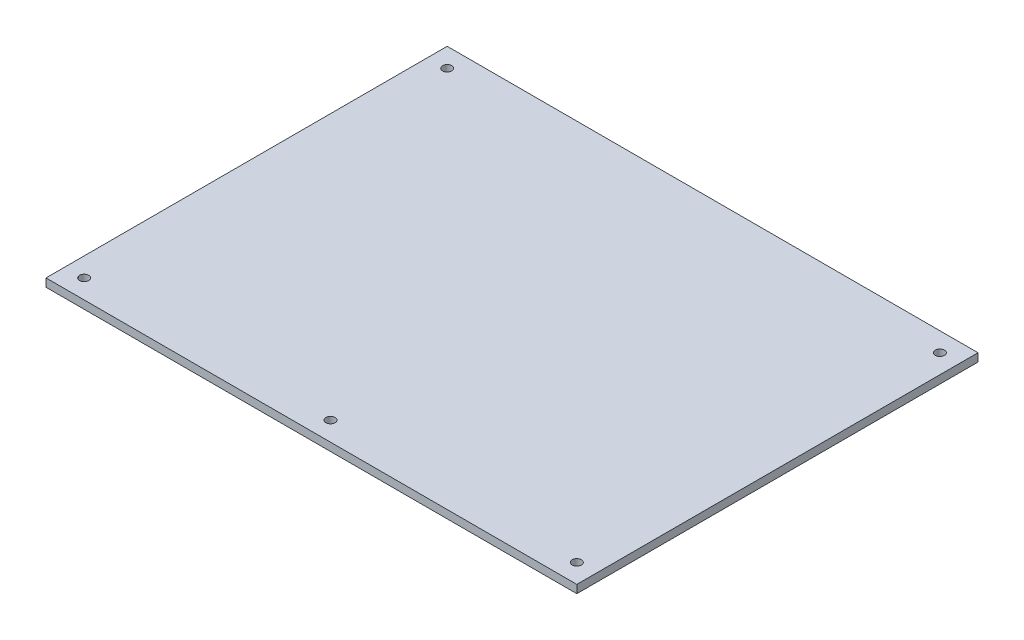
ISO-10303-21;
HEADER;
FILE_DESCRIPTION(('STEP AP214'),'2;1');
FILE_NAME('part.step','',(''),(''),'','','');
FILE_SCHEMA(('AUTOMOTIVE_DESIGN { 1 0 10303 214 1 1 1 1 }'));
ENDSEC;
DATA;
#1=APPLICATION_CONTEXT('core data for automotive mechanical design processes');
#2=APPLICATION_PROTOCOL_DEFINITION('international standard','automotive_design',2000,#1);
#3=PRODUCT_CONTEXT('',#1,'mechanical');
#4=PRODUCT('Part','Part','',(#3));
#5=PRODUCT_RELATED_PRODUCT_CATEGORY('part','',(#4));
#6=PRODUCT_DEFINITION_FORMATION('','',#4);
#7=PRODUCT_DEFINITION_CONTEXT('part definition',#1,'design');
#8=PRODUCT_DEFINITION('design','',#6,#7);
#9=PRODUCT_DEFINITION_SHAPE('','',#8);
#10=(LENGTH_UNIT() NAMED_UNIT(*) SI_UNIT(.MILLI.,.METRE.));
#11=(NAMED_UNIT(*) PLANE_ANGLE_UNIT() SI_UNIT($,.RADIAN.));
#12=(NAMED_UNIT(*) SI_UNIT($,.STERADIAN.) SOLID_ANGLE_UNIT());
#13=UNCERTAINTY_MEASURE_WITH_UNIT(LENGTH_MEASURE(1.E-05),#10,'distance_accuracy_value','');
#14=(GEOMETRIC_REPRESENTATION_CONTEXT(3) GLOBAL_UNCERTAINTY_ASSIGNED_CONTEXT((#13)) GLOBAL_UNIT_ASSIGNED_CONTEXT((#10,
#11,#12)) REPRESENTATION_CONTEXT('',''));
#15=CARTESIAN_POINT('',(0.,0.,0.));
#16=DIRECTION('',(0.,0.,1.));
#17=DIRECTION('',(1.,0.,0.));
#18=AXIS2_PLACEMENT_3D('',#15,#16,#17);
#19=CARTESIAN_POINT('',(169.960120169601,6.35,301.624858514461));
#20=DIRECTION('',(-1.,0.,0.));
#21=DIRECTION('',(0.,0.,1.));
#22=AXIS2_PLACEMENT_3D('',#19,#20,#21);
#23=PLANE('',#22);
#24=DIRECTION('',(0.,0.,-1.));
#25=VECTOR('',#24,1.);
#26=CARTESIAN_POINT('',(169.960120169601,0.,301.624858514461));
#27=LINE('',#26,#25);
#28=CARTESIAN_POINT('',(169.960120169601,0.,301.624858514461));
#29=VERTEX_POINT('',#28);
#30=CARTESIAN_POINT('',(169.960120169601,0.,-12.8551414855386));
#31=VERTEX_POINT('',#30);
#32=EDGE_CURVE('E104',#29,#31,#27,.T.);
#33=ORIENTED_EDGE('',*,*,#32,.T.);
#34=DIRECTION('',(0.,-1.,0.));
#35=VECTOR('',#34,1.);
#36=CARTESIAN_POINT('',(169.960120169601,6.35,-12.8551414855386));
#37=LINE('',#36,#35);
#38=CARTESIAN_POINT('',(169.960120169601,6.35,-12.8551414855386));
#39=VERTEX_POINT('',#38);
#40=EDGE_CURVE('E11',#39,#31,#37,.T.);
#41=ORIENTED_EDGE('',*,*,#40,.F.);
#42=DIRECTION('',(0.,0.,-1.));
#43=VECTOR('',#42,1.);
#44=CARTESIAN_POINT('',(169.960120169601,6.35,301.624858514461));
#45=LINE('',#44,#43);
#46=CARTESIAN_POINT('',(169.960120169601,6.35,301.624858514461));
#47=VERTEX_POINT('',#46);
#48=EDGE_CURVE('E92',#47,#39,#45,.T.);
#49=ORIENTED_EDGE('',*,*,#48,.F.);
#50=DIRECTION('',(0.,-1.,0.));
#51=VECTOR('',#50,1.);
#52=CARTESIAN_POINT('',(169.960120169601,6.35,301.624858514461));
#53=LINE('',#52,#51);
#54=EDGE_CURVE('E100',#47,#29,#53,.T.);
#55=ORIENTED_EDGE('',*,*,#54,.T.);
#56=EDGE_LOOP('',(#33,#41,#49,#55));
#57=FACE_BOUND('',#56,.T.);
#58=ADVANCED_FACE('F41',(#57),#23,.F.);
#59=CARTESIAN_POINT('',(-246.119879830399,6.35,-12.8551414855386));
#60=DIRECTION('',(0.,0.,1.));
#61=DIRECTION('',(1.,0.,0.));
#62=AXIS2_PLACEMENT_3D('',#59,#60,#61);
#63=PLANE('',#62);
#64=DIRECTION('',(-1.,0.,0.));
#65=VECTOR('',#64,1.);
#66=CARTESIAN_POINT('',(-246.119879830399,0.,-12.8551414855386));
#67=LINE('',#66,#65);
#68=CARTESIAN_POINT('',(-246.119879830399,0.,-12.8551414855386));
#69=VERTEX_POINT('',#68);
#70=EDGE_CURVE('E96',#31,#69,#67,.T.);
#71=ORIENTED_EDGE('',*,*,#70,.T.);
#72=DIRECTION('',(0.,-1.,0.));
#73=VECTOR('',#72,1.);
#74=CARTESIAN_POINT('',(-246.119879830399,6.35,-12.8551414855386));
#75=LINE('',#74,#73);
#76=CARTESIAN_POINT('',(-246.119879830399,6.35,-12.8551414855386));
#77=VERTEX_POINT('',#76);
#78=EDGE_CURVE('E49',#77,#69,#75,.T.);
#79=ORIENTED_EDGE('',*,*,#78,.F.);
#80=DIRECTION('',(-1.,0.,0.));
#81=VECTOR('',#80,1.);
#82=CARTESIAN_POINT('',(-246.119879830399,6.35,-12.8551414855386));
#83=LINE('',#82,#81);
#84=EDGE_CURVE('E87',#39,#77,#83,.T.);
#85=ORIENTED_EDGE('',*,*,#84,.F.);
#86=ORIENTED_EDGE('',*,*,#40,.T.);
#87=EDGE_LOOP('',(#71,#79,#85,#86));
#88=FACE_BOUND('',#87,.T.);
#89=ADVANCED_FACE('F95',(#88),#63,.F.);
#90=CARTESIAN_POINT('',(-246.119879830399,6.35,301.624858514461));
#91=DIRECTION('',(1.,0.,0.));
#92=DIRECTION('',(0.,0.,-1.));
#93=AXIS2_PLACEMENT_3D('',#90,#91,#92);
#94=PLANE('',#93);
#95=DIRECTION('',(0.,0.,1.));
#96=VECTOR('',#95,1.);
#97=CARTESIAN_POINT('',(-246.119879830399,0.,301.624858514461));
#98=LINE('',#97,#96);
#99=CARTESIAN_POINT('',(-246.119879830399,0.,301.624858514461));
#100=VERTEX_POINT('',#99);
#101=EDGE_CURVE('E74',#69,#100,#98,.T.);
#102=ORIENTED_EDGE('',*,*,#101,.T.);
#103=DIRECTION('',(0.,-1.,0.));
#104=VECTOR('',#103,1.);
#105=CARTESIAN_POINT('',(-246.119879830399,6.35,301.624858514461));
#106=LINE('',#105,#104);
#107=CARTESIAN_POINT('',(-246.119879830399,6.35,301.624858514461));
#108=VERTEX_POINT('',#107);
#109=EDGE_CURVE('E97',#108,#100,#106,.T.);
#110=ORIENTED_EDGE('',*,*,#109,.F.);
#111=DIRECTION('',(0.,0.,1.));
#112=VECTOR('',#111,1.);
#113=CARTESIAN_POINT('',(-246.119879830399,6.35,301.624858514461));
#114=LINE('',#113,#112);
#115=EDGE_CURVE('E90',#77,#108,#114,.T.);
#116=ORIENTED_EDGE('',*,*,#115,.F.);
#117=ORIENTED_EDGE('',*,*,#78,.T.);
#118=EDGE_LOOP('',(#102,#110,#116,#117));
#119=FACE_BOUND('',#118,.T.);
#120=ADVANCED_FACE('F98',(#119),#94,.F.);
#121=CARTESIAN_POINT('',(-246.119879830399,6.35,301.624858514461));
#122=DIRECTION('',(0.,0.,-1.));
#123=DIRECTION('',(-1.,0.,0.));
#124=AXIS2_PLACEMENT_3D('',#121,#122,#123);
#125=PLANE('',#124);
#126=DIRECTION('',(1.,0.,0.));
#127=VECTOR('',#126,1.);
#128=CARTESIAN_POINT('',(-246.119879830399,0.,301.624858514461));
#129=LINE('',#128,#127);
#130=EDGE_CURVE('E80',#100,#29,#129,.T.);
#131=ORIENTED_EDGE('',*,*,#130,.T.);
#132=ORIENTED_EDGE('',*,*,#54,.F.);
#133=DIRECTION('',(1.,0.,0.));
#134=VECTOR('',#133,1.);
#135=CARTESIAN_POINT('',(-246.119879830399,6.35,301.624858514461));
#136=LINE('',#135,#134);
#137=EDGE_CURVE('E57',#108,#47,#136,.T.);
#138=ORIENTED_EDGE('',*,*,#137,.F.);
#139=ORIENTED_EDGE('',*,*,#109,.T.);
#140=EDGE_LOOP('',(#131,#132,#138,#139));
#141=FACE_BOUND('',#140,.T.);
#142=ADVANCED_FACE('F112',(#141),#125,.F.);
#143=CARTESIAN_POINT('',(0.,6.35,0.));
#144=DIRECTION('',(0.,-1.,0.));
#145=DIRECTION('',(0.,0.,-1.));
#146=AXIS2_PLACEMENT_3D('',#143,#144,#145);
#147=PLANE('',#146);
#148=CARTESIAN_POINT('',(-231.169879830399,6.35,286.674858514461));
#149=DIRECTION('',(0.,1.,0.));
#150=DIRECTION('',(0.,0.,1.));
#151=AXIS2_PLACEMENT_3D('',#148,#149,#150);
#152=CIRCLE('',#151,3.59999999999998);
#153=CARTESIAN_POINT('',(-231.169879830399,6.35,290.274858514461));
#154=VERTEX_POINT('',#153);
#155=EDGE_CURVE('E127',#154,#154,#152,.T.);
#156=ORIENTED_EDGE('',*,*,#155,.F.);
#157=EDGE_LOOP('',(#156));
#158=FACE_BOUND('',#157,.T.);
#159=CARTESIAN_POINT('',(-38.079879830399,6.35,286.674858514461));
#160=DIRECTION('',(0.,1.,0.));
#161=DIRECTION('',(0.,0.,1.));
#162=AXIS2_PLACEMENT_3D('',#159,#160,#161);
#163=CIRCLE('',#162,3.59999999999999);
#164=CARTESIAN_POINT('',(-38.079879830399,6.35,290.274858514461));
#165=VERTEX_POINT('',#164);
#166=EDGE_CURVE('E133',#165,#165,#163,.T.);
#167=ORIENTED_EDGE('',*,*,#166,.F.);
#168=EDGE_LOOP('',(#167));
#169=FACE_BOUND('',#168,.T.);
#170=CARTESIAN_POINT('',(155.010120169601,6.35,286.674858514461));
#171=DIRECTION('',(0.,1.,0.));
#172=DIRECTION('',(0.,0.,1.));
#173=AXIS2_PLACEMENT_3D('',#170,#171,#172);
#174=CIRCLE('',#173,3.59999999999998);
#175=CARTESIAN_POINT('',(155.010120169601,6.35,290.274858514461));
#176=VERTEX_POINT('',#175);
#177=EDGE_CURVE('E139',#176,#176,#174,.T.);
#178=ORIENTED_EDGE('',*,*,#177,.F.);
#179=EDGE_LOOP('',(#178));
#180=FACE_BOUND('',#179,.T.);
#181=CARTESIAN_POINT('',(155.010120169601,6.35,2.09485851446137));
#182=DIRECTION('',(0.,1.,0.));
#183=DIRECTION('',(0.,0.,1.));
#184=AXIS2_PLACEMENT_3D('',#181,#182,#183);
#185=CIRCLE('',#184,3.59999999999999);
#186=CARTESIAN_POINT('',(155.010120169601,6.35,5.69485851446135));
#187=VERTEX_POINT('',#186);
#188=EDGE_CURVE('E121',#187,#187,#185,.T.);
#189=ORIENTED_EDGE('',*,*,#188,.F.);
#190=EDGE_LOOP('',(#189));
#191=FACE_BOUND('',#190,.T.);
#192=CARTESIAN_POINT('',(-231.169879830399,6.35,2.09485851446137));
#193=DIRECTION('',(0.,1.,0.));
#194=DIRECTION('',(0.,0.,1.));
#195=AXIS2_PLACEMENT_3D('',#192,#193,#194);
#196=CIRCLE('',#195,3.59999999999999);
#197=CARTESIAN_POINT('',(-231.169879830399,6.35,5.69485851446135));
#198=VERTEX_POINT('',#197);
#199=EDGE_CURVE('E118',#198,#198,#196,.T.);
#200=ORIENTED_EDGE('',*,*,#199,.F.);
#201=EDGE_LOOP('',(#200));
#202=FACE_BOUND('',#201,.T.);
#203=ORIENTED_EDGE('',*,*,#48,.T.);
#204=ORIENTED_EDGE('',*,*,#84,.T.);
#205=ORIENTED_EDGE('',*,*,#115,.T.);
#206=ORIENTED_EDGE('',*,*,#137,.T.);
#207=EDGE_LOOP('',(#203,#204,#205,#206));
#208=FACE_BOUND('',#207,.T.);
#209=ADVANCED_FACE('F88',(#158,#169,#180,#191,#202,#208),#147,.F.);
#210=CARTESIAN_POINT('',(0.,0.,0.));
#211=DIRECTION('',(0.,-1.,0.));
#212=DIRECTION('',(0.,0.,-1.));
#213=AXIS2_PLACEMENT_3D('',#210,#211,#212);
#214=PLANE('',#213);
#215=CARTESIAN_POINT('',(-231.169879830399,0.,286.674858514461));
#216=DIRECTION('',(0.,1.,0.));
#217=DIRECTION('',(0.,0.,1.));
#218=AXIS2_PLACEMENT_3D('',#215,#216,#217);
#219=CIRCLE('',#218,3.59999999999998);
#220=CARTESIAN_POINT('',(-231.169879830399,0.,290.274858514461));
#221=VERTEX_POINT('',#220);
#222=EDGE_CURVE('E124',#221,#221,#219,.T.);
#223=ORIENTED_EDGE('',*,*,#222,.T.);
#224=EDGE_LOOP('',(#223));
#225=FACE_BOUND('',#224,.T.);
#226=CARTESIAN_POINT('',(-38.079879830399,0.,286.674858514461));
#227=DIRECTION('',(0.,1.,0.));
#228=DIRECTION('',(0.,0.,1.));
#229=AXIS2_PLACEMENT_3D('',#226,#227,#228);
#230=CIRCLE('',#229,3.59999999999999);
#231=CARTESIAN_POINT('',(-38.079879830399,0.,290.274858514461));
#232=VERTEX_POINT('',#231);
#233=EDGE_CURVE('E130',#232,#232,#230,.T.);
#234=ORIENTED_EDGE('',*,*,#233,.T.);
#235=EDGE_LOOP('',(#234));
#236=FACE_BOUND('',#235,.T.);
#237=CARTESIAN_POINT('',(155.010120169601,0.,286.674858514461));
#238=DIRECTION('',(0.,1.,0.));
#239=DIRECTION('',(0.,0.,1.));
#240=AXIS2_PLACEMENT_3D('',#237,#238,#239);
#241=CIRCLE('',#240,3.59999999999998);
#242=CARTESIAN_POINT('',(155.010120169601,0.,290.274858514461));
#243=VERTEX_POINT('',#242);
#244=EDGE_CURVE('E136',#243,#243,#241,.T.);
#245=ORIENTED_EDGE('',*,*,#244,.T.);
#246=EDGE_LOOP('',(#245));
#247=FACE_BOUND('',#246,.T.);
#248=CARTESIAN_POINT('',(155.010120169601,0.,2.09485851446137));
#249=DIRECTION('',(0.,1.,0.));
#250=DIRECTION('',(0.,0.,1.));
#251=AXIS2_PLACEMENT_3D('',#248,#249,#250);
#252=CIRCLE('',#251,3.59999999999999);
#253=CARTESIAN_POINT('',(155.010120169601,0.,5.69485851446135));
#254=VERTEX_POINT('',#253);
#255=EDGE_CURVE('E142',#254,#254,#252,.T.);
#256=ORIENTED_EDGE('',*,*,#255,.T.);
#257=EDGE_LOOP('',(#256));
#258=FACE_BOUND('',#257,.T.);
#259=CARTESIAN_POINT('',(-231.169879830399,0.,2.09485851446137));
#260=DIRECTION('',(0.,1.,0.));
#261=DIRECTION('',(0.,0.,1.));
#262=AXIS2_PLACEMENT_3D('',#259,#260,#261);
#263=CIRCLE('',#262,3.59999999999999);
#264=CARTESIAN_POINT('',(-231.169879830399,0.,5.69485851446135));
#265=VERTEX_POINT('',#264);
#266=EDGE_CURVE('E107',#265,#265,#263,.T.);
#267=ORIENTED_EDGE('',*,*,#266,.T.);
#268=EDGE_LOOP('',(#267));
#269=FACE_BOUND('',#268,.T.);
#270=ORIENTED_EDGE('',*,*,#32,.F.);
#271=ORIENTED_EDGE('',*,*,#130,.F.);
#272=ORIENTED_EDGE('',*,*,#101,.F.);
#273=ORIENTED_EDGE('',*,*,#70,.F.);
#274=EDGE_LOOP('',(#270,#271,#272,#273));
#275=FACE_BOUND('',#274,.T.);
#276=ADVANCED_FACE('F115',(#225,#236,#247,#258,#269,#275),#214,.T.);
#277=CARTESIAN_POINT('',(-231.169879830399,0.,2.09485851446137));
#278=DIRECTION('',(0.,1.,0.));
#279=DIRECTION('',(0.,0.,1.));
#280=AXIS2_PLACEMENT_3D('',#277,#278,#279);
#281=CYLINDRICAL_SURFACE('',#280,3.59999999999999);
#282=ORIENTED_EDGE('',*,*,#266,.F.);
#283=EDGE_LOOP('',(#282));
#284=FACE_BOUND('',#283,.T.);
#285=ORIENTED_EDGE('',*,*,#199,.T.);
#286=EDGE_LOOP('',(#285));
#287=FACE_BOUND('',#286,.T.);
#288=ADVANCED_FACE('F156',(#284,#287),#281,.F.);
#289=CARTESIAN_POINT('',(155.010120169601,0.,2.09485851446137));
#290=DIRECTION('',(0.,1.,0.));
#291=DIRECTION('',(0.,0.,1.));
#292=AXIS2_PLACEMENT_3D('',#289,#290,#291);
#293=CYLINDRICAL_SURFACE('',#292,3.59999999999999);
#294=ORIENTED_EDGE('',*,*,#255,.F.);
#295=EDGE_LOOP('',(#294));
#296=FACE_BOUND('',#295,.T.);
#297=ORIENTED_EDGE('',*,*,#188,.T.);
#298=EDGE_LOOP('',(#297));
#299=FACE_BOUND('',#298,.T.);
#300=ADVANCED_FACE('F148',(#296,#299),#293,.F.);
#301=CARTESIAN_POINT('',(155.010120169601,0.,286.674858514461));
#302=DIRECTION('',(0.,1.,0.));
#303=DIRECTION('',(0.,0.,1.));
#304=AXIS2_PLACEMENT_3D('',#301,#302,#303);
#305=CYLINDRICAL_SURFACE('',#304,3.59999999999998);
#306=ORIENTED_EDGE('',*,*,#244,.F.);
#307=EDGE_LOOP('',(#306));
#308=FACE_BOUND('',#307,.T.);
#309=ORIENTED_EDGE('',*,*,#177,.T.);
#310=EDGE_LOOP('',(#309));
#311=FACE_BOUND('',#310,.T.);
#312=ADVANCED_FACE('F164',(#308,#311),#305,.F.);
#313=CARTESIAN_POINT('',(-38.079879830399,0.,286.674858514461));
#314=DIRECTION('',(0.,1.,0.));
#315=DIRECTION('',(0.,0.,1.));
#316=AXIS2_PLACEMENT_3D('',#313,#314,#315);
#317=CYLINDRICAL_SURFACE('',#316,3.59999999999999);
#318=ORIENTED_EDGE('',*,*,#233,.F.);
#319=EDGE_LOOP('',(#318));
#320=FACE_BOUND('',#319,.T.);
#321=ORIENTED_EDGE('',*,*,#166,.T.);
#322=EDGE_LOOP('',(#321));
#323=FACE_BOUND('',#322,.T.);
#324=ADVANCED_FACE('F215',(#320,#323),#317,.F.);
#325=CARTESIAN_POINT('',(-231.169879830399,0.,286.674858514461));
#326=DIRECTION('',(0.,1.,0.));
#327=DIRECTION('',(0.,0.,1.));
#328=AXIS2_PLACEMENT_3D('',#325,#326,#327);
#329=CYLINDRICAL_SURFACE('',#328,3.59999999999998);
#330=ORIENTED_EDGE('',*,*,#222,.F.);
#331=EDGE_LOOP('',(#330));
#332=FACE_BOUND('',#331,.T.);
#333=ORIENTED_EDGE('',*,*,#155,.T.);
#334=EDGE_LOOP('',(#333));
#335=FACE_BOUND('',#334,.T.);
#336=ADVANCED_FACE('F225',(#332,#335),#329,.F.);
#337=CLOSED_SHELL('',(#58,#89,#120,#142,#209,#276,#288,#300,#312,#324,#336));
#338=MANIFOLD_SOLID_BREP('B2',#337);
#339=ADVANCED_BREP_SHAPE_REPRESENTATION('',(#18,#338),#14);
#340=SHAPE_DEFINITION_REPRESENTATION(#9,#339);
ENDSEC;
END-ISO-10303-21;
